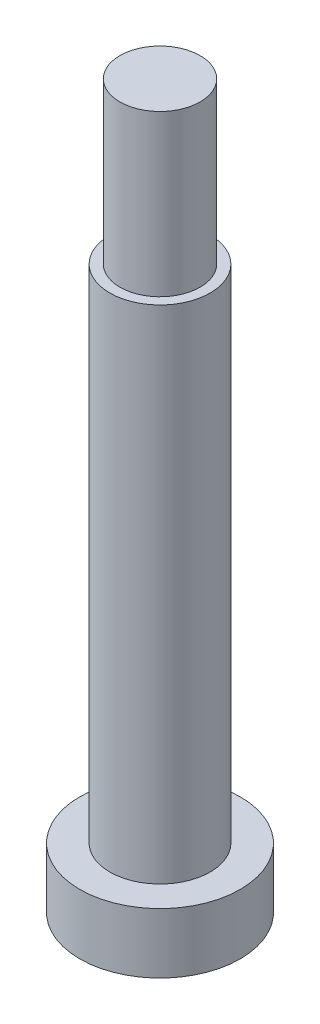
ISO-10303-21;
HEADER;
FILE_DESCRIPTION(('STEP AP214'),'2;1');
FILE_NAME('part.step','',(''),(''),'','','');
FILE_SCHEMA(('AUTOMOTIVE_DESIGN { 1 0 10303 214 1 1 1 1 }'));
ENDSEC;
DATA;
#1=APPLICATION_CONTEXT('core data for automotive mechanical design processes');
#2=APPLICATION_PROTOCOL_DEFINITION('international standard','automotive_design',2000,#1);
#3=PRODUCT_CONTEXT('',#1,'mechanical');
#4=PRODUCT('Part','Part','',(#3));
#5=PRODUCT_RELATED_PRODUCT_CATEGORY('part','',(#4));
#6=PRODUCT_DEFINITION_FORMATION('','',#4);
#7=PRODUCT_DEFINITION_CONTEXT('part definition',#1,'design');
#8=PRODUCT_DEFINITION('design','',#6,#7);
#9=PRODUCT_DEFINITION_SHAPE('','',#8);
#10=(LENGTH_UNIT() NAMED_UNIT(*) SI_UNIT(.MILLI.,.METRE.));
#11=(NAMED_UNIT(*) PLANE_ANGLE_UNIT() SI_UNIT($,.RADIAN.));
#12=(NAMED_UNIT(*) SI_UNIT($,.STERADIAN.) SOLID_ANGLE_UNIT());
#13=UNCERTAINTY_MEASURE_WITH_UNIT(LENGTH_MEASURE(1.E-05),#10,'distance_accuracy_value','');
#14=(GEOMETRIC_REPRESENTATION_CONTEXT(3) GLOBAL_UNCERTAINTY_ASSIGNED_CONTEXT((#13)) GLOBAL_UNIT_ASSIGNED_CONTEXT((#10,
#11,#12)) REPRESENTATION_CONTEXT('',''));
#15=CARTESIAN_POINT('',(0.,0.,0.));
#16=DIRECTION('',(0.,0.,1.));
#17=DIRECTION('',(1.,0.,0.));
#18=AXIS2_PLACEMENT_3D('',#15,#16,#17);
#19=CARTESIAN_POINT('',(0.,25.,0.));
#20=DIRECTION('',(0.,-1.,0.));
#21=DIRECTION('',(0.,0.,-1.));
#22=AXIS2_PLACEMENT_3D('',#19,#20,#21);
#23=CYLINDRICAL_SURFACE('',#22,2.5);
#24=CARTESIAN_POINT('',(0.,25.,0.));
#25=DIRECTION('',(0.,1.,0.));
#26=DIRECTION('',(0.,0.,1.));
#27=AXIS2_PLACEMENT_3D('',#24,#25,#26);
#28=CIRCLE('',#27,2.5);
#29=CARTESIAN_POINT('',(0.,25.,2.5));
#30=VERTEX_POINT('',#29);
#31=EDGE_CURVE('E43',#30,#30,#28,.T.);
#32=ORIENTED_EDGE('',*,*,#31,.F.);
#33=EDGE_LOOP('',(#32));
#34=FACE_BOUND('',#33,.T.);
#35=CARTESIAN_POINT('',(0.,0.,0.));
#36=DIRECTION('',(0.,1.,0.));
#37=DIRECTION('',(0.,0.,1.));
#38=AXIS2_PLACEMENT_3D('',#35,#36,#37);
#39=CIRCLE('',#38,2.5);
#40=CARTESIAN_POINT('',(0.,0.,2.5));
#41=VERTEX_POINT('',#40);
#42=EDGE_CURVE('E39',#41,#41,#39,.T.);
#43=ORIENTED_EDGE('',*,*,#42,.T.);
#44=EDGE_LOOP('',(#43));
#45=FACE_BOUND('',#44,.T.);
#46=ADVANCED_FACE('F36',(#34,#45),#23,.T.);
#47=CARTESIAN_POINT('',(0.,25.,0.));
#48=DIRECTION('',(0.,1.,0.));
#49=DIRECTION('',(0.,0.,1.));
#50=AXIS2_PLACEMENT_3D('',#47,#48,#49);
#51=PLANE('',#50);
#52=CARTESIAN_POINT('',(0.,25.,0.));
#53=DIRECTION('',(0.,1.,0.));
#54=DIRECTION('',(0.,0.,1.));
#55=AXIS2_PLACEMENT_3D('',#52,#53,#54);
#56=CIRCLE('',#55,2.);
#57=CARTESIAN_POINT('',(0.,25.,2.));
#58=VERTEX_POINT('',#57);
#59=EDGE_CURVE('E10',#58,#58,#56,.T.);
#60=ORIENTED_EDGE('',*,*,#59,.F.);
#61=EDGE_LOOP('',(#60));
#62=FACE_BOUND('',#61,.T.);
#63=ORIENTED_EDGE('',*,*,#31,.T.);
#64=EDGE_LOOP('',(#63));
#65=FACE_BOUND('',#64,.T.);
#66=ADVANCED_FACE('F84',(#62,#65),#51,.T.);
#67=CARTESIAN_POINT('',(0.,33.,0.));
#68=DIRECTION('',(0.,-1.,0.));
#69=DIRECTION('',(0.,0.,-1.));
#70=AXIS2_PLACEMENT_3D('',#67,#68,#69);
#71=CYLINDRICAL_SURFACE('',#70,2.);
#72=CARTESIAN_POINT('',(0.,33.,0.));
#73=DIRECTION('',(0.,1.,0.));
#74=DIRECTION('',(0.,0.,1.));
#75=AXIS2_PLACEMENT_3D('',#72,#73,#74);
#76=CIRCLE('',#75,2.);
#77=CARTESIAN_POINT('',(0.,33.,2.));
#78=VERTEX_POINT('',#77);
#79=EDGE_CURVE('E48',#78,#78,#76,.T.);
#80=ORIENTED_EDGE('',*,*,#79,.F.);
#81=EDGE_LOOP('',(#80));
#82=FACE_BOUND('',#81,.T.);
#83=ORIENTED_EDGE('',*,*,#59,.T.);
#84=EDGE_LOOP('',(#83));
#85=FACE_BOUND('',#84,.T.);
#86=ADVANCED_FACE('F80',(#82,#85),#71,.T.);
#87=CARTESIAN_POINT('',(0.,33.,0.));
#88=DIRECTION('',(0.,1.,0.));
#89=DIRECTION('',(0.,0.,1.));
#90=AXIS2_PLACEMENT_3D('',#87,#88,#89);
#91=PLANE('',#90);
#92=ORIENTED_EDGE('',*,*,#79,.T.);
#93=EDGE_LOOP('',(#92));
#94=FACE_BOUND('',#93,.T.);
#95=ADVANCED_FACE('F72',(#94),#91,.T.);
#96=CARTESIAN_POINT('',(0.,-3.,0.));
#97=DIRECTION('',(0.,1.,0.));
#98=DIRECTION('',(0.,0.,1.));
#99=AXIS2_PLACEMENT_3D('',#96,#97,#98);
#100=CYLINDRICAL_SURFACE('',#99,4.);
#101=CARTESIAN_POINT('',(0.,-3.,0.));
#102=DIRECTION('',(0.,-1.,0.));
#103=DIRECTION('',(0.,0.,-1.));
#104=AXIS2_PLACEMENT_3D('',#101,#102,#103);
#105=CIRCLE('',#104,4.);
#106=CARTESIAN_POINT('',(0.,-3.,-4.));
#107=VERTEX_POINT('',#106);
#108=EDGE_CURVE('E55',#107,#107,#105,.T.);
#109=ORIENTED_EDGE('',*,*,#108,.F.);
#110=EDGE_LOOP('',(#109));
#111=FACE_BOUND('',#110,.T.);
#112=CARTESIAN_POINT('',(0.,0.,0.));
#113=DIRECTION('',(0.,-1.,0.));
#114=DIRECTION('',(0.,0.,-1.));
#115=AXIS2_PLACEMENT_3D('',#112,#113,#114);
#116=CIRCLE('',#115,4.);
#117=CARTESIAN_POINT('',(0.,0.,-4.));
#118=VERTEX_POINT('',#117);
#119=EDGE_CURVE('E52',#118,#118,#116,.T.);
#120=ORIENTED_EDGE('',*,*,#119,.T.);
#121=EDGE_LOOP('',(#120));
#122=FACE_BOUND('',#121,.T.);
#123=ADVANCED_FACE('F70',(#111,#122),#100,.T.);
#124=CARTESIAN_POINT('',(0.,-3.,0.));
#125=DIRECTION('',(0.,-1.,0.));
#126=DIRECTION('',(0.,0.,-1.));
#127=AXIS2_PLACEMENT_3D('',#124,#125,#126);
#128=PLANE('',#127);
#129=ORIENTED_EDGE('',*,*,#108,.T.);
#130=EDGE_LOOP('',(#129));
#131=FACE_BOUND('',#130,.T.);
#132=ADVANCED_FACE('F66',(#131),#128,.T.);
#133=CARTESIAN_POINT('',(0.,0.,0.));
#134=DIRECTION('',(0.,-1.,0.));
#135=DIRECTION('',(0.,0.,-1.));
#136=AXIS2_PLACEMENT_3D('',#133,#134,#135);
#137=PLANE('',#136);
#138=ORIENTED_EDGE('',*,*,#42,.F.);
#139=EDGE_LOOP('',(#138));
#140=FACE_BOUND('',#139,.T.);
#141=ORIENTED_EDGE('',*,*,#119,.F.);
#142=EDGE_LOOP('',(#141));
#143=FACE_BOUND('',#142,.T.);
#144=ADVANCED_FACE('F63',(#140,#143),#137,.F.);
#145=CLOSED_SHELL('',(#46,#66,#86,#95,#123,#132,#144));
#146=MANIFOLD_SOLID_BREP('B2',#145);
#147=ADVANCED_BREP_SHAPE_REPRESENTATION('',(#18,#146),#14);
#148=SHAPE_DEFINITION_REPRESENTATION(#9,#147);
ENDSEC;
END-ISO-10303-21;
